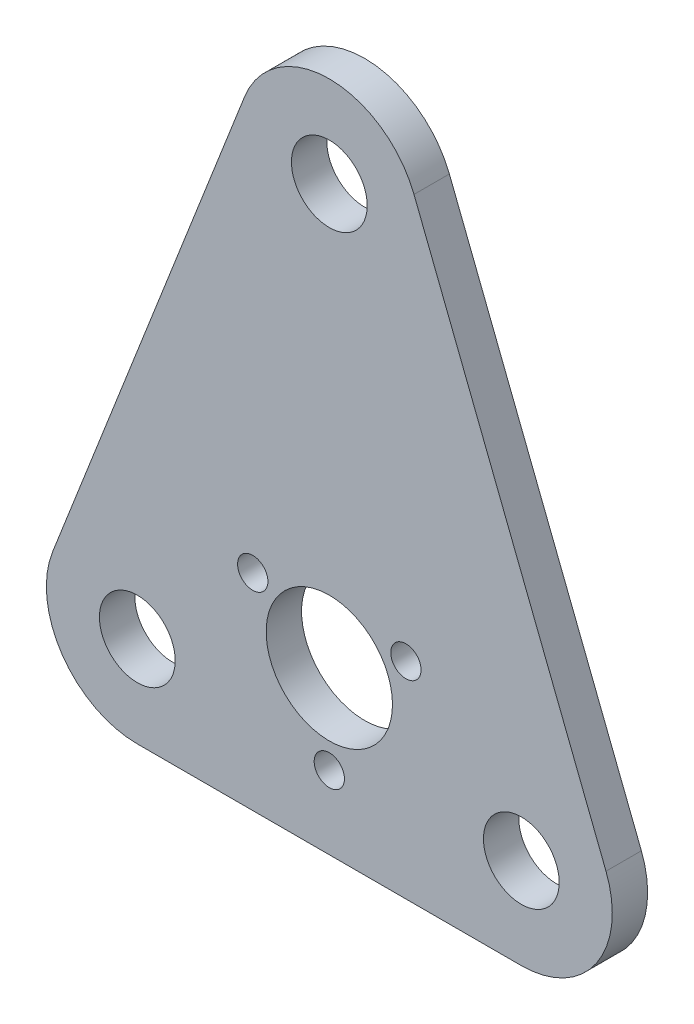
ISO-10303-21;
HEADER;
FILE_DESCRIPTION(('STEP AP214'),'2;1');
FILE_NAME('part.step','',(''),(''),'','','');
FILE_SCHEMA(('AUTOMOTIVE_DESIGN { 1 0 10303 214 1 1 1 1 }'));
ENDSEC;
DATA;
#1=APPLICATION_CONTEXT('core data for automotive mechanical design processes');
#2=APPLICATION_PROTOCOL_DEFINITION('international standard','automotive_design',2000,#1);
#3=PRODUCT_CONTEXT('',#1,'mechanical');
#4=PRODUCT('Part','Part','',(#3));
#5=PRODUCT_RELATED_PRODUCT_CATEGORY('part','',(#4));
#6=PRODUCT_DEFINITION_FORMATION('','',#4);
#7=PRODUCT_DEFINITION_CONTEXT('part definition',#1,'design');
#8=PRODUCT_DEFINITION('design','',#6,#7);
#9=PRODUCT_DEFINITION_SHAPE('','',#8);
#10=(LENGTH_UNIT() NAMED_UNIT(*) SI_UNIT(.MILLI.,.METRE.));
#11=(NAMED_UNIT(*) PLANE_ANGLE_UNIT() SI_UNIT($,.RADIAN.));
#12=(NAMED_UNIT(*) SI_UNIT($,.STERADIAN.) SOLID_ANGLE_UNIT());
#13=UNCERTAINTY_MEASURE_WITH_UNIT(LENGTH_MEASURE(1.E-05),#10,'distance_accuracy_value','');
#14=(GEOMETRIC_REPRESENTATION_CONTEXT(3) GLOBAL_UNCERTAINTY_ASSIGNED_CONTEXT((#13)) GLOBAL_UNIT_ASSIGNED_CONTEXT((#10,
#11,#12)) REPRESENTATION_CONTEXT('',''));
#15=CARTESIAN_POINT('',(0.,0.,0.));
#16=DIRECTION('',(0.,0.,1.));
#17=DIRECTION('',(1.,0.,0.));
#18=AXIS2_PLACEMENT_3D('',#15,#16,#17);
#19=CARTESIAN_POINT('',(38.,0.,7.));
#20=DIRECTION('',(0.,0.,1.));
#21=DIRECTION('',(1.,0.,0.));
#22=AXIS2_PLACEMENT_3D('',#19,#20,#21);
#23=PLANE('',#22);
#24=CARTESIAN_POINT('',(-15.1554445662276,22.7500000000001,7.));
#25=DIRECTION('',(0.,0.,1.));
#26=DIRECTION('',(1.,0.,0.));
#27=AXIS2_PLACEMENT_3D('',#24,#25,#26);
#28=CIRCLE('',#27,3.);
#29=CARTESIAN_POINT('',(-12.1554445662276,22.7500000000001,7.));
#30=VERTEX_POINT('',#29);
#31=EDGE_CURVE('E204',#30,#30,#28,.T.);
#32=ORIENTED_EDGE('',*,*,#31,.F.);
#33=EDGE_LOOP('',(#32));
#34=FACE_BOUND('',#33,.T.);
#35=CARTESIAN_POINT('',(0.,14.,7.));
#36=DIRECTION('',(0.,0.,1.));
#37=DIRECTION('',(1.,0.,0.));
#38=AXIS2_PLACEMENT_3D('',#35,#36,#37);
#39=CIRCLE('',#38,12.5);
#40=CARTESIAN_POINT('',(12.5,14.,7.));
#41=VERTEX_POINT('',#40);
#42=EDGE_CURVE('E216',#41,#41,#39,.T.);
#43=ORIENTED_EDGE('',*,*,#42,.F.);
#44=EDGE_LOOP('',(#43));
#45=FACE_BOUND('',#44,.T.);
#46=CARTESIAN_POINT('',(-38.,0.,7.));
#47=DIRECTION('',(0.,0.,1.));
#48=DIRECTION('',(1.,0.,0.));
#49=AXIS2_PLACEMENT_3D('',#46,#47,#48);
#50=CIRCLE('',#49,7.5);
#51=CARTESIAN_POINT('',(-30.5,0.,7.));
#52=VERTEX_POINT('',#51);
#53=EDGE_CURVE('E228',#52,#52,#50,.T.);
#54=ORIENTED_EDGE('',*,*,#53,.F.);
#55=EDGE_LOOP('',(#54));
#56=FACE_BOUND('',#55,.T.);
#57=CARTESIAN_POINT('',(38.,0.,7.));
#58=DIRECTION('',(0.,0.,1.));
#59=DIRECTION('',(1.,0.,0.));
#60=AXIS2_PLACEMENT_3D('',#57,#58,#59);
#61=CIRCLE('',#60,18.);
#62=CARTESIAN_POINT('',(38.,-18.,7.));
#63=VERTEX_POINT('',#62);
#64=CARTESIAN_POINT('',(54.7598195313465,6.56570249681615,7.));
#65=VERTEX_POINT('',#64);
#66=EDGE_CURVE('E132',#63,#65,#61,.T.);
#67=ORIENTED_EDGE('',*,*,#66,.T.);
#68=DIRECTION('',(-0.364761249823119,0.931101085074803,0.));
#69=VECTOR('',#68,1.);
#70=CARTESIAN_POINT('',(54.7598195313465,6.56570249681615,7.));
#71=LINE('',#70,#69);
#72=CARTESIAN_POINT('',(16.7598195313464,103.565702496816,7.));
#73=VERTEX_POINT('',#72);
#74=EDGE_CURVE('E90',#65,#73,#71,.T.);
#75=ORIENTED_EDGE('',*,*,#74,.T.);
#76=CARTESIAN_POINT('',(0.,97.,7.));
#77=DIRECTION('',(0.,0.,1.));
#78=DIRECTION('',(1.,0.,0.));
#79=AXIS2_PLACEMENT_3D('',#76,#77,#78);
#80=CIRCLE('',#79,18.);
#81=CARTESIAN_POINT('',(-16.7598195313464,103.565702496816,7.));
#82=VERTEX_POINT('',#81);
#83=EDGE_CURVE('E103',#73,#82,#80,.T.);
#84=ORIENTED_EDGE('',*,*,#83,.T.);
#85=DIRECTION('',(-0.364761249823119,-0.931101085074803,0.));
#86=VECTOR('',#85,1.);
#87=CARTESIAN_POINT('',(-54.7598195313465,6.56570249681615,7.));
#88=LINE('',#87,#86);
#89=CARTESIAN_POINT('',(-54.7598195313465,6.56570249681615,7.));
#90=VERTEX_POINT('',#89);
#91=EDGE_CURVE('E97',#82,#90,#88,.T.);
#92=ORIENTED_EDGE('',*,*,#91,.T.);
#93=CARTESIAN_POINT('',(-38.,0.,7.));
#94=DIRECTION('',(0.,0.,1.));
#95=DIRECTION('',(1.,0.,0.));
#96=AXIS2_PLACEMENT_3D('',#93,#94,#95);
#97=CIRCLE('',#96,18.);
#98=CARTESIAN_POINT('',(-38.,-18.,7.));
#99=VERTEX_POINT('',#98);
#100=EDGE_CURVE('E101',#90,#99,#97,.T.);
#101=ORIENTED_EDGE('',*,*,#100,.T.);
#102=DIRECTION('',(1.,0.,0.));
#103=VECTOR('',#102,1.);
#104=CARTESIAN_POINT('',(-38.,-18.,7.));
#105=LINE('',#104,#103);
#106=EDGE_CURVE('E53',#99,#63,#105,.T.);
#107=ORIENTED_EDGE('',*,*,#106,.T.);
#108=EDGE_LOOP('',(#67,#75,#84,#92,#101,#107));
#109=FACE_BOUND('',#108,.T.);
#110=CARTESIAN_POINT('',(0.,97.,7.));
#111=DIRECTION('',(0.,0.,1.));
#112=DIRECTION('',(1.,0.,0.));
#113=AXIS2_PLACEMENT_3D('',#110,#111,#112);
#114=CIRCLE('',#113,7.5);
#115=CARTESIAN_POINT('',(7.5,97.,7.));
#116=VERTEX_POINT('',#115);
#117=EDGE_CURVE('E125',#116,#116,#114,.T.);
#118=ORIENTED_EDGE('',*,*,#117,.F.);
#119=EDGE_LOOP('',(#118));
#120=FACE_BOUND('',#119,.T.);
#121=CARTESIAN_POINT('',(38.,0.,7.));
#122=DIRECTION('',(0.,0.,1.));
#123=DIRECTION('',(1.,0.,0.));
#124=AXIS2_PLACEMENT_3D('',#121,#122,#123);
#125=CIRCLE('',#124,7.5);
#126=CARTESIAN_POINT('',(45.5,0.,7.));
#127=VERTEX_POINT('',#126);
#128=EDGE_CURVE('E222',#127,#127,#125,.T.);
#129=ORIENTED_EDGE('',*,*,#128,.F.);
#130=EDGE_LOOP('',(#129));
#131=FACE_BOUND('',#130,.T.);
#132=CARTESIAN_POINT('',(0.,-3.5,7.));
#133=DIRECTION('',(0.,0.,1.));
#134=DIRECTION('',(1.,0.,0.));
#135=AXIS2_PLACEMENT_3D('',#132,#133,#134);
#136=CIRCLE('',#135,3.);
#137=CARTESIAN_POINT('',(3.,-3.5,7.));
#138=VERTEX_POINT('',#137);
#139=EDGE_CURVE('E210',#138,#138,#136,.T.);
#140=ORIENTED_EDGE('',*,*,#139,.F.);
#141=EDGE_LOOP('',(#140));
#142=FACE_BOUND('',#141,.T.);
#143=CARTESIAN_POINT('',(15.1554445662278,22.7499999999999,7.));
#144=DIRECTION('',(0.,0.,1.));
#145=DIRECTION('',(1.,0.,0.));
#146=AXIS2_PLACEMENT_3D('',#143,#144,#145);
#147=CIRCLE('',#146,3.);
#148=CARTESIAN_POINT('',(18.1554445662278,22.7499999999999,7.));
#149=VERTEX_POINT('',#148);
#150=EDGE_CURVE('E195',#149,#149,#147,.T.);
#151=ORIENTED_EDGE('',*,*,#150,.F.);
#152=EDGE_LOOP('',(#151));
#153=FACE_BOUND('',#152,.T.);
#154=ADVANCED_FACE('F36',(#34,#45,#56,#109,#120,#131,#142,#153),#23,.T.);
#155=CARTESIAN_POINT('',(38.,0.,0.));
#156=DIRECTION('',(0.,0.,1.));
#157=DIRECTION('',(1.,0.,0.));
#158=AXIS2_PLACEMENT_3D('',#155,#156,#157);
#159=PLANE('',#158);
#160=CARTESIAN_POINT('',(38.,0.,0.));
#161=DIRECTION('',(0.,0.,1.));
#162=DIRECTION('',(1.,0.,0.));
#163=AXIS2_PLACEMENT_3D('',#160,#161,#162);
#164=CIRCLE('',#163,18.);
#165=CARTESIAN_POINT('',(38.,-18.,0.));
#166=VERTEX_POINT('',#165);
#167=CARTESIAN_POINT('',(54.7598195313465,6.56570249681615,0.));
#168=VERTEX_POINT('',#167);
#169=EDGE_CURVE('E121',#166,#168,#164,.T.);
#170=ORIENTED_EDGE('',*,*,#169,.F.);
#171=DIRECTION('',(1.,0.,0.));
#172=VECTOR('',#171,1.);
#173=CARTESIAN_POINT('',(-38.,-18.,0.));
#174=LINE('',#173,#172);
#175=CARTESIAN_POINT('',(-38.,-18.,0.));
#176=VERTEX_POINT('',#175);
#177=EDGE_CURVE('E82',#176,#166,#174,.T.);
#178=ORIENTED_EDGE('',*,*,#177,.F.);
#179=CARTESIAN_POINT('',(-38.,0.,0.));
#180=DIRECTION('',(0.,0.,1.));
#181=DIRECTION('',(1.,0.,0.));
#182=AXIS2_PLACEMENT_3D('',#179,#180,#181);
#183=CIRCLE('',#182,18.);
#184=CARTESIAN_POINT('',(-54.7598195313465,6.56570249681615,0.));
#185=VERTEX_POINT('',#184);
#186=EDGE_CURVE('E76',#185,#176,#183,.T.);
#187=ORIENTED_EDGE('',*,*,#186,.F.);
#188=DIRECTION('',(-0.364761249823119,-0.931101085074803,0.));
#189=VECTOR('',#188,1.);
#190=CARTESIAN_POINT('',(-54.7598195313465,6.56570249681615,0.));
#191=LINE('',#190,#189);
#192=CARTESIAN_POINT('',(-16.7598195313464,103.565702496816,0.));
#193=VERTEX_POINT('',#192);
#194=EDGE_CURVE('E111',#193,#185,#191,.T.);
#195=ORIENTED_EDGE('',*,*,#194,.F.);
#196=CARTESIAN_POINT('',(0.,97.,0.));
#197=DIRECTION('',(0.,0.,1.));
#198=DIRECTION('',(1.,0.,0.));
#199=AXIS2_PLACEMENT_3D('',#196,#197,#198);
#200=CIRCLE('',#199,18.);
#201=CARTESIAN_POINT('',(16.7598195313464,103.565702496816,0.));
#202=VERTEX_POINT('',#201);
#203=EDGE_CURVE('E127',#202,#193,#200,.T.);
#204=ORIENTED_EDGE('',*,*,#203,.F.);
#205=DIRECTION('',(-0.364761249823119,0.931101085074803,0.));
#206=VECTOR('',#205,1.);
#207=CARTESIAN_POINT('',(54.7598195313465,6.56570249681615,0.));
#208=LINE('',#207,#206);
#209=EDGE_CURVE('E124',#168,#202,#208,.T.);
#210=ORIENTED_EDGE('',*,*,#209,.F.);
#211=EDGE_LOOP('',(#170,#178,#187,#195,#204,#210));
#212=FACE_BOUND('',#211,.T.);
#213=CARTESIAN_POINT('',(0.,97.,0.));
#214=DIRECTION('',(0.,0.,1.));
#215=DIRECTION('',(1.,0.,0.));
#216=AXIS2_PLACEMENT_3D('',#213,#214,#215);
#217=CIRCLE('',#216,7.5);
#218=CARTESIAN_POINT('',(7.5,97.,0.));
#219=VERTEX_POINT('',#218);
#220=EDGE_CURVE('E231',#219,#219,#217,.T.);
#221=ORIENTED_EDGE('',*,*,#220,.T.);
#222=EDGE_LOOP('',(#221));
#223=FACE_BOUND('',#222,.T.);
#224=CARTESIAN_POINT('',(-38.,0.,0.));
#225=DIRECTION('',(0.,0.,1.));
#226=DIRECTION('',(1.,0.,0.));
#227=AXIS2_PLACEMENT_3D('',#224,#225,#226);
#228=CIRCLE('',#227,7.5);
#229=CARTESIAN_POINT('',(-30.5,0.,0.));
#230=VERTEX_POINT('',#229);
#231=EDGE_CURVE('E225',#230,#230,#228,.T.);
#232=ORIENTED_EDGE('',*,*,#231,.T.);
#233=EDGE_LOOP('',(#232));
#234=FACE_BOUND('',#233,.T.);
#235=CARTESIAN_POINT('',(38.,0.,0.));
#236=DIRECTION('',(0.,0.,1.));
#237=DIRECTION('',(1.,0.,0.));
#238=AXIS2_PLACEMENT_3D('',#235,#236,#237);
#239=CIRCLE('',#238,7.5);
#240=CARTESIAN_POINT('',(45.5,0.,0.));
#241=VERTEX_POINT('',#240);
#242=EDGE_CURVE('E219',#241,#241,#239,.T.);
#243=ORIENTED_EDGE('',*,*,#242,.T.);
#244=EDGE_LOOP('',(#243));
#245=FACE_BOUND('',#244,.T.);
#246=CARTESIAN_POINT('',(0.,14.,0.));
#247=DIRECTION('',(0.,0.,1.));
#248=DIRECTION('',(1.,0.,0.));
#249=AXIS2_PLACEMENT_3D('',#246,#247,#248);
#250=CIRCLE('',#249,12.5);
#251=CARTESIAN_POINT('',(12.5,14.,0.));
#252=VERTEX_POINT('',#251);
#253=EDGE_CURVE('E213',#252,#252,#250,.T.);
#254=ORIENTED_EDGE('',*,*,#253,.T.);
#255=EDGE_LOOP('',(#254));
#256=FACE_BOUND('',#255,.T.);
#257=CARTESIAN_POINT('',(0.,-3.5,0.));
#258=DIRECTION('',(0.,0.,1.));
#259=DIRECTION('',(1.,0.,0.));
#260=AXIS2_PLACEMENT_3D('',#257,#258,#259);
#261=CIRCLE('',#260,3.);
#262=CARTESIAN_POINT('',(3.,-3.5,0.));
#263=VERTEX_POINT('',#262);
#264=EDGE_CURVE('E207',#263,#263,#261,.T.);
#265=ORIENTED_EDGE('',*,*,#264,.T.);
#266=EDGE_LOOP('',(#265));
#267=FACE_BOUND('',#266,.T.);
#268=CARTESIAN_POINT('',(-15.1554445662276,22.7500000000001,0.));
#269=DIRECTION('',(0.,0.,1.));
#270=DIRECTION('',(1.,0.,0.));
#271=AXIS2_PLACEMENT_3D('',#268,#269,#270);
#272=CIRCLE('',#271,3.);
#273=CARTESIAN_POINT('',(-12.1554445662276,22.7500000000001,0.));
#274=VERTEX_POINT('',#273);
#275=EDGE_CURVE('E201',#274,#274,#272,.T.);
#276=ORIENTED_EDGE('',*,*,#275,.T.);
#277=EDGE_LOOP('',(#276));
#278=FACE_BOUND('',#277,.T.);
#279=CARTESIAN_POINT('',(15.1554445662278,22.7499999999999,0.));
#280=DIRECTION('',(0.,0.,1.));
#281=DIRECTION('',(1.,0.,0.));
#282=AXIS2_PLACEMENT_3D('',#279,#280,#281);
#283=CIRCLE('',#282,3.);
#284=CARTESIAN_POINT('',(18.1554445662278,22.7499999999999,0.));
#285=VERTEX_POINT('',#284);
#286=EDGE_CURVE('E198',#285,#285,#283,.T.);
#287=ORIENTED_EDGE('',*,*,#286,.T.);
#288=EDGE_LOOP('',(#287));
#289=FACE_BOUND('',#288,.T.);
#290=ADVANCED_FACE('F141',(#212,#223,#234,#245,#256,#267,#278,#289),#159,.F.);
#291=CARTESIAN_POINT('',(38.,0.,7.));
#292=DIRECTION('',(0.,0.,-1.));
#293=DIRECTION('',(-1.,0.,0.));
#294=AXIS2_PLACEMENT_3D('',#291,#292,#293);
#295=CYLINDRICAL_SURFACE('',#294,18.);
#296=ORIENTED_EDGE('',*,*,#169,.T.);
#297=DIRECTION('',(0.,0.,-1.));
#298=VECTOR('',#297,1.);
#299=CARTESIAN_POINT('',(54.7598195313465,6.56570249681615,7.));
#300=LINE('',#299,#298);
#301=EDGE_CURVE('E11',#65,#168,#300,.T.);
#302=ORIENTED_EDGE('',*,*,#301,.F.);
#303=ORIENTED_EDGE('',*,*,#66,.F.);
#304=DIRECTION('',(0.,0.,-1.));
#305=VECTOR('',#304,1.);
#306=CARTESIAN_POINT('',(38.,-18.,7.));
#307=LINE('',#306,#305);
#308=EDGE_CURVE('E117',#63,#166,#307,.T.);
#309=ORIENTED_EDGE('',*,*,#308,.T.);
#310=EDGE_LOOP('',(#296,#302,#303,#309));
#311=FACE_BOUND('',#310,.T.);
#312=ADVANCED_FACE('F38',(#311),#295,.T.);
#313=CARTESIAN_POINT('',(54.7598195313465,6.56570249681615,7.));
#314=DIRECTION('',(-0.931101085074803,-0.364761249823119,0.));
#315=DIRECTION('',(0.364761249823119,-0.931101085074803,0.));
#316=AXIS2_PLACEMENT_3D('',#313,#314,#315);
#317=PLANE('',#316);
#318=ORIENTED_EDGE('',*,*,#209,.T.);
#319=DIRECTION('',(0.,0.,-1.));
#320=VECTOR('',#319,1.);
#321=CARTESIAN_POINT('',(16.7598195313464,103.565702496816,7.));
#322=LINE('',#321,#320);
#323=EDGE_CURVE('E45',#73,#202,#322,.T.);
#324=ORIENTED_EDGE('',*,*,#323,.F.);
#325=ORIENTED_EDGE('',*,*,#74,.F.);
#326=ORIENTED_EDGE('',*,*,#301,.T.);
#327=EDGE_LOOP('',(#318,#324,#325,#326));
#328=FACE_BOUND('',#327,.T.);
#329=ADVANCED_FACE('F320',(#328),#317,.F.);
#330=CARTESIAN_POINT('',(0.,97.,7.));
#331=DIRECTION('',(0.,0.,-1.));
#332=DIRECTION('',(-1.,0.,0.));
#333=AXIS2_PLACEMENT_3D('',#330,#331,#332);
#334=CYLINDRICAL_SURFACE('',#333,18.);
#335=ORIENTED_EDGE('',*,*,#203,.T.);
#336=DIRECTION('',(0.,0.,-1.));
#337=VECTOR('',#336,1.);
#338=CARTESIAN_POINT('',(-16.7598195313464,103.565702496816,7.));
#339=LINE('',#338,#337);
#340=EDGE_CURVE('E112',#82,#193,#339,.T.);
#341=ORIENTED_EDGE('',*,*,#340,.F.);
#342=ORIENTED_EDGE('',*,*,#83,.F.);
#343=ORIENTED_EDGE('',*,*,#323,.T.);
#344=EDGE_LOOP('',(#335,#341,#342,#343));
#345=FACE_BOUND('',#344,.T.);
#346=ADVANCED_FACE('F138',(#345),#334,.T.);
#347=CARTESIAN_POINT('',(-54.7598195313465,6.56570249681615,7.));
#348=DIRECTION('',(0.931101085074803,-0.364761249823119,0.));
#349=DIRECTION('',(0.364761249823119,0.931101085074803,0.));
#350=AXIS2_PLACEMENT_3D('',#347,#348,#349);
#351=PLANE('',#350);
#352=ORIENTED_EDGE('',*,*,#194,.T.);
#353=DIRECTION('',(0.,0.,-1.));
#354=VECTOR('',#353,1.);
#355=CARTESIAN_POINT('',(-54.7598195313465,6.56570249681615,7.));
#356=LINE('',#355,#354);
#357=EDGE_CURVE('E108',#90,#185,#356,.T.);
#358=ORIENTED_EDGE('',*,*,#357,.F.);
#359=ORIENTED_EDGE('',*,*,#91,.F.);
#360=ORIENTED_EDGE('',*,*,#340,.T.);
#361=EDGE_LOOP('',(#352,#358,#359,#360));
#362=FACE_BOUND('',#361,.T.);
#363=ADVANCED_FACE('F109',(#362),#351,.F.);
#364=CARTESIAN_POINT('',(-38.,0.,7.));
#365=DIRECTION('',(0.,0.,-1.));
#366=DIRECTION('',(-1.,0.,0.));
#367=AXIS2_PLACEMENT_3D('',#364,#365,#366);
#368=CYLINDRICAL_SURFACE('',#367,18.);
#369=ORIENTED_EDGE('',*,*,#186,.T.);
#370=DIRECTION('',(0.,0.,-1.));
#371=VECTOR('',#370,1.);
#372=CARTESIAN_POINT('',(-38.,-18.,7.));
#373=LINE('',#372,#371);
#374=EDGE_CURVE('E113',#99,#176,#373,.T.);
#375=ORIENTED_EDGE('',*,*,#374,.F.);
#376=ORIENTED_EDGE('',*,*,#100,.F.);
#377=ORIENTED_EDGE('',*,*,#357,.T.);
#378=EDGE_LOOP('',(#369,#375,#376,#377));
#379=FACE_BOUND('',#378,.T.);
#380=ADVANCED_FACE('F115',(#379),#368,.T.);
#381=CARTESIAN_POINT('',(-38.,-18.,7.));
#382=DIRECTION('',(0.,1.,0.));
#383=DIRECTION('',(-1.,0.,0.));
#384=AXIS2_PLACEMENT_3D('',#381,#382,#383);
#385=PLANE('',#384);
#386=ORIENTED_EDGE('',*,*,#177,.T.);
#387=ORIENTED_EDGE('',*,*,#308,.F.);
#388=ORIENTED_EDGE('',*,*,#106,.F.);
#389=ORIENTED_EDGE('',*,*,#374,.T.);
#390=EDGE_LOOP('',(#386,#387,#388,#389));
#391=FACE_BOUND('',#390,.T.);
#392=ADVANCED_FACE('F146',(#391),#385,.F.);
#393=CARTESIAN_POINT('',(0.,97.,7.));
#394=DIRECTION('',(0.,0.,-1.));
#395=DIRECTION('',(-1.,0.,0.));
#396=AXIS2_PLACEMENT_3D('',#393,#394,#395);
#397=CYLINDRICAL_SURFACE('',#396,7.5);
#398=ORIENTED_EDGE('',*,*,#117,.T.);
#399=EDGE_LOOP('',(#398));
#400=FACE_BOUND('',#399,.T.);
#401=ORIENTED_EDGE('',*,*,#220,.F.);
#402=EDGE_LOOP('',(#401));
#403=FACE_BOUND('',#402,.T.);
#404=ADVANCED_FACE('F148',(#400,#403),#397,.F.);
#405=CARTESIAN_POINT('',(-38.,0.,7.));
#406=DIRECTION('',(0.,0.,-1.));
#407=DIRECTION('',(-1.,0.,0.));
#408=AXIS2_PLACEMENT_3D('',#405,#406,#407);
#409=CYLINDRICAL_SURFACE('',#408,7.5);
#410=ORIENTED_EDGE('',*,*,#53,.T.);
#411=EDGE_LOOP('',(#410));
#412=FACE_BOUND('',#411,.T.);
#413=ORIENTED_EDGE('',*,*,#231,.F.);
#414=EDGE_LOOP('',(#413));
#415=FACE_BOUND('',#414,.T.);
#416=ADVANCED_FACE('F154',(#412,#415),#409,.F.);
#417=CARTESIAN_POINT('',(38.,0.,7.));
#418=DIRECTION('',(0.,0.,-1.));
#419=DIRECTION('',(-1.,0.,0.));
#420=AXIS2_PLACEMENT_3D('',#417,#418,#419);
#421=CYLINDRICAL_SURFACE('',#420,7.5);
#422=ORIENTED_EDGE('',*,*,#128,.T.);
#423=EDGE_LOOP('',(#422));
#424=FACE_BOUND('',#423,.T.);
#425=ORIENTED_EDGE('',*,*,#242,.F.);
#426=EDGE_LOOP('',(#425));
#427=FACE_BOUND('',#426,.T.);
#428=ADVANCED_FACE('F170',(#424,#427),#421,.F.);
#429=CARTESIAN_POINT('',(0.,14.,7.));
#430=DIRECTION('',(0.,0.,-1.));
#431=DIRECTION('',(-1.,0.,0.));
#432=AXIS2_PLACEMENT_3D('',#429,#430,#431);
#433=CYLINDRICAL_SURFACE('',#432,12.5);
#434=ORIENTED_EDGE('',*,*,#42,.T.);
#435=EDGE_LOOP('',(#434));
#436=FACE_BOUND('',#435,.T.);
#437=ORIENTED_EDGE('',*,*,#253,.F.);
#438=EDGE_LOOP('',(#437));
#439=FACE_BOUND('',#438,.T.);
#440=ADVANCED_FACE('F174',(#436,#439),#433,.F.);
#441=CARTESIAN_POINT('',(0.,-3.5,7.));
#442=DIRECTION('',(0.,0.,-1.));
#443=DIRECTION('',(-1.,0.,0.));
#444=AXIS2_PLACEMENT_3D('',#441,#442,#443);
#445=CYLINDRICAL_SURFACE('',#444,3.);
#446=ORIENTED_EDGE('',*,*,#139,.T.);
#447=EDGE_LOOP('',(#446));
#448=FACE_BOUND('',#447,.T.);
#449=ORIENTED_EDGE('',*,*,#264,.F.);
#450=EDGE_LOOP('',(#449));
#451=FACE_BOUND('',#450,.T.);
#452=ADVANCED_FACE('F178',(#448,#451),#445,.F.);
#453=CARTESIAN_POINT('',(-15.1554445662276,22.7500000000001,7.));
#454=DIRECTION('',(0.,0.,-1.));
#455=DIRECTION('',(-1.,0.,0.));
#456=AXIS2_PLACEMENT_3D('',#453,#454,#455);
#457=CYLINDRICAL_SURFACE('',#456,3.);
#458=ORIENTED_EDGE('',*,*,#31,.T.);
#459=EDGE_LOOP('',(#458));
#460=FACE_BOUND('',#459,.T.);
#461=ORIENTED_EDGE('',*,*,#275,.F.);
#462=EDGE_LOOP('',(#461));
#463=FACE_BOUND('',#462,.T.);
#464=ADVANCED_FACE('F182',(#460,#463),#457,.F.);
#465=CARTESIAN_POINT('',(15.1554445662278,22.7499999999999,7.));
#466=DIRECTION('',(0.,0.,-1.));
#467=DIRECTION('',(-1.,0.,0.));
#468=AXIS2_PLACEMENT_3D('',#465,#466,#467);
#469=CYLINDRICAL_SURFACE('',#468,3.);
#470=ORIENTED_EDGE('',*,*,#150,.T.);
#471=EDGE_LOOP('',(#470));
#472=FACE_BOUND('',#471,.T.);
#473=ORIENTED_EDGE('',*,*,#286,.F.);
#474=EDGE_LOOP('',(#473));
#475=FACE_BOUND('',#474,.T.);
#476=ADVANCED_FACE('F186',(#472,#475),#469,.F.);
#477=CLOSED_SHELL('',(#154,#290,#312,#329,#346,#363,#380,#392,#404,#416,#428,#440,#452,#464,#476));
#478=MANIFOLD_SOLID_BREP('B2',#477);
#479=ADVANCED_BREP_SHAPE_REPRESENTATION('',(#18,#478),#14);
#480=SHAPE_DEFINITION_REPRESENTATION(#9,#479);
ENDSEC;
END-ISO-10303-21;
